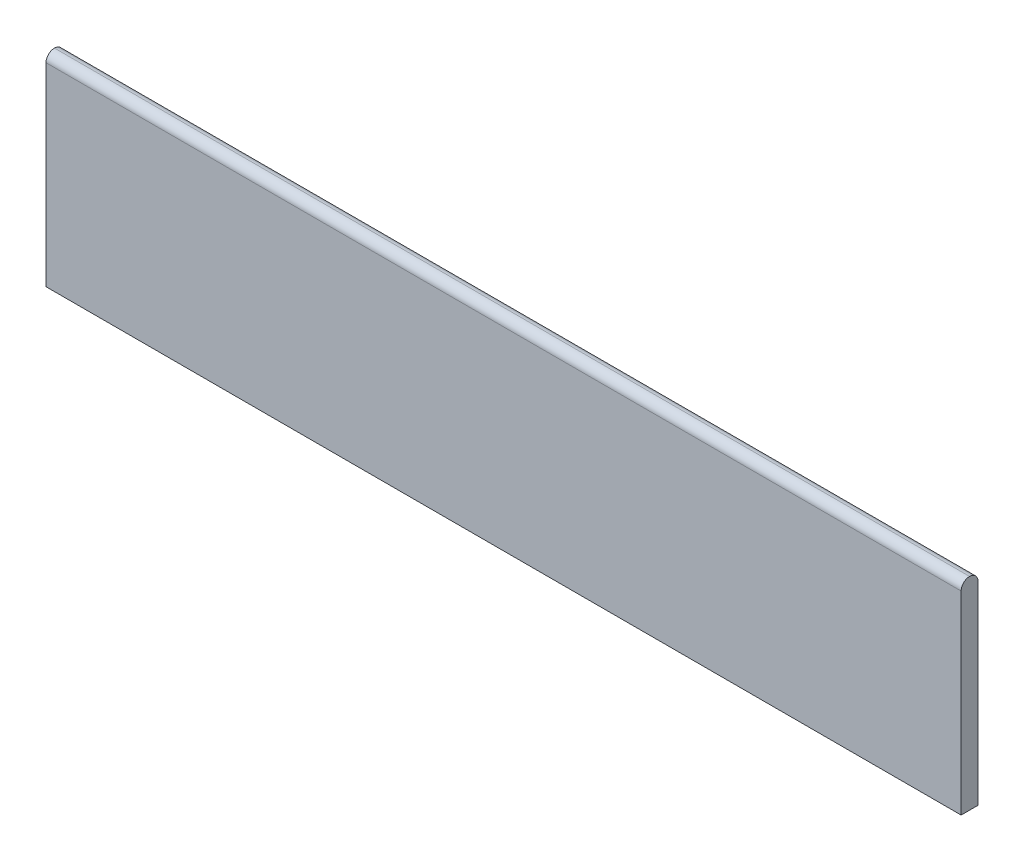
ISO-10303-21;
HEADER;
FILE_DESCRIPTION(('STEP AP214'),'2;1');
FILE_NAME('part.step','',(''),(''),'','','');
FILE_SCHEMA(('AUTOMOTIVE_DESIGN { 1 0 10303 214 1 1 1 1 }'));
ENDSEC;
DATA;
#1=APPLICATION_CONTEXT('core data for automotive mechanical design processes');
#2=APPLICATION_PROTOCOL_DEFINITION('international standard','automotive_design',2000,#1);
#3=PRODUCT_CONTEXT('',#1,'mechanical');
#4=PRODUCT('Part','Part','',(#3));
#5=PRODUCT_RELATED_PRODUCT_CATEGORY('part','',(#4));
#6=PRODUCT_DEFINITION_FORMATION('','',#4);
#7=PRODUCT_DEFINITION_CONTEXT('part definition',#1,'design');
#8=PRODUCT_DEFINITION('design','',#6,#7);
#9=PRODUCT_DEFINITION_SHAPE('','',#8);
#10=(LENGTH_UNIT() NAMED_UNIT(*) SI_UNIT(.MILLI.,.METRE.));
#11=(NAMED_UNIT(*) PLANE_ANGLE_UNIT() SI_UNIT($,.RADIAN.));
#12=(NAMED_UNIT(*) SI_UNIT($,.STERADIAN.) SOLID_ANGLE_UNIT());
#13=UNCERTAINTY_MEASURE_WITH_UNIT(LENGTH_MEASURE(1.E-05),#10,'distance_accuracy_value','');
#14=(GEOMETRIC_REPRESENTATION_CONTEXT(3) GLOBAL_UNCERTAINTY_ASSIGNED_CONTEXT((#13)) GLOBAL_UNIT_ASSIGNED_CONTEXT((#10,
#11,#12)) REPRESENTATION_CONTEXT('',''));
#15=CARTESIAN_POINT('',(0.,0.,0.));
#16=DIRECTION('',(0.,0.,1.));
#17=DIRECTION('',(1.,0.,0.));
#18=AXIS2_PLACEMENT_3D('',#15,#16,#17);
#19=CARTESIAN_POINT('',(0.,0.,12.5));
#20=DIRECTION('',(1.,0.,0.));
#21=DIRECTION('',(0.,0.,-1.));
#22=AXIS2_PLACEMENT_3D('',#19,#20,#21);
#23=PLANE('',#22);
#24=CARTESIAN_POINT('',(0.,143.75,6.25));
#25=DIRECTION('',(1.,0.,0.));
#26=DIRECTION('',(0.,0.,-1.));
#27=AXIS2_PLACEMENT_3D('',#24,#25,#26);
#28=CIRCLE('',#27,6.25);
#29=CARTESIAN_POINT('',(0.,143.75,12.5));
#30=VERTEX_POINT('',#29);
#31=CARTESIAN_POINT('',(0.,150.,6.25));
#32=VERTEX_POINT('',#31);
#33=EDGE_CURVE('E103',#30,#32,#28,.F.);
#34=ORIENTED_EDGE('',*,*,#33,.T.);
#35=CARTESIAN_POINT('',(0.,143.75,6.25));
#36=DIRECTION('',(1.,0.,0.));
#37=DIRECTION('',(0.,0.,-1.));
#38=AXIS2_PLACEMENT_3D('',#35,#36,#37);
#39=CIRCLE('',#38,6.25);
#40=CARTESIAN_POINT('',(0.,143.75,0.));
#41=VERTEX_POINT('',#40);
#42=EDGE_CURVE('E56',#32,#41,#39,.F.);
#43=ORIENTED_EDGE('',*,*,#42,.T.);
#44=DIRECTION('',(0.,-1.,0.));
#45=VECTOR('',#44,1.);
#46=CARTESIAN_POINT('',(0.,0.,0.));
#47=LINE('',#46,#45);
#48=CARTESIAN_POINT('',(0.,0.,0.));
#49=VERTEX_POINT('',#48);
#50=EDGE_CURVE('E100',#41,#49,#47,.T.);
#51=ORIENTED_EDGE('',*,*,#50,.T.);
#52=DIRECTION('',(0.,0.,-1.));
#53=VECTOR('',#52,1.);
#54=CARTESIAN_POINT('',(0.,0.,12.5));
#55=LINE('',#54,#53);
#56=CARTESIAN_POINT('',(0.,0.,12.5));
#57=VERTEX_POINT('',#56);
#58=EDGE_CURVE('E94',#57,#49,#55,.T.);
#59=ORIENTED_EDGE('',*,*,#58,.F.);
#60=DIRECTION('',(0.,-1.,0.));
#61=VECTOR('',#60,1.);
#62=CARTESIAN_POINT('',(0.,0.,12.5));
#63=LINE('',#62,#61);
#64=EDGE_CURVE('E80',#30,#57,#63,.T.);
#65=ORIENTED_EDGE('',*,*,#64,.F.);
#66=EDGE_LOOP('',(#34,#43,#51,#59,#65));
#67=FACE_BOUND('',#66,.T.);
#68=ADVANCED_FACE('F34',(#67),#23,.F.);
#69=CARTESIAN_POINT('',(0.,0.,12.5));
#70=DIRECTION('',(0.,1.,0.));
#71=DIRECTION('',(0.,0.,1.));
#72=AXIS2_PLACEMENT_3D('',#69,#70,#71);
#73=PLANE('',#72);
#74=DIRECTION('',(1.,0.,0.));
#75=VECTOR('',#74,1.);
#76=CARTESIAN_POINT('',(0.,0.,0.));
#77=LINE('',#76,#75);
#78=CARTESIAN_POINT('',(678.,0.,0.));
#79=VERTEX_POINT('',#78);
#80=EDGE_CURVE('E178',#49,#79,#77,.T.);
#81=ORIENTED_EDGE('',*,*,#80,.T.);
#82=DIRECTION('',(0.,0.,-1.));
#83=VECTOR('',#82,1.);
#84=CARTESIAN_POINT('',(678.,0.,12.5));
#85=LINE('',#84,#83);
#86=CARTESIAN_POINT('',(678.,0.,12.5));
#87=VERTEX_POINT('',#86);
#88=EDGE_CURVE('E96',#87,#79,#85,.T.);
#89=ORIENTED_EDGE('',*,*,#88,.F.);
#90=DIRECTION('',(1.,0.,0.));
#91=VECTOR('',#90,1.);
#92=CARTESIAN_POINT('',(0.,0.,12.5));
#93=LINE('',#92,#91);
#94=EDGE_CURVE('E84',#57,#87,#93,.T.);
#95=ORIENTED_EDGE('',*,*,#94,.F.);
#96=ORIENTED_EDGE('',*,*,#58,.T.);
#97=EDGE_LOOP('',(#81,#89,#95,#96));
#98=FACE_BOUND('',#97,.T.);
#99=ADVANCED_FACE('F93',(#98),#73,.F.);
#100=CARTESIAN_POINT('',(678.,0.,12.5));
#101=DIRECTION('',(-1.,0.,0.));
#102=DIRECTION('',(0.,0.,1.));
#103=AXIS2_PLACEMENT_3D('',#100,#101,#102);
#104=PLANE('',#103);
#105=DIRECTION('',(0.,1.,0.));
#106=VECTOR('',#105,1.);
#107=CARTESIAN_POINT('',(678.,0.,0.));
#108=LINE('',#107,#106);
#109=CARTESIAN_POINT('',(678.,143.75,0.));
#110=VERTEX_POINT('',#109);
#111=EDGE_CURVE('E89',#79,#110,#108,.T.);
#112=ORIENTED_EDGE('',*,*,#111,.T.);
#113=CARTESIAN_POINT('',(678.,143.75,6.25));
#114=DIRECTION('',(-1.,0.,0.));
#115=DIRECTION('',(0.,0.,1.));
#116=AXIS2_PLACEMENT_3D('',#113,#114,#115);
#117=CIRCLE('',#116,6.25);
#118=CARTESIAN_POINT('',(678.,150.,6.25));
#119=VERTEX_POINT('',#118);
#120=EDGE_CURVE('E11',#110,#119,#117,.F.);
#121=ORIENTED_EDGE('',*,*,#120,.T.);
#122=CARTESIAN_POINT('',(678.,143.75,6.25));
#123=DIRECTION('',(-1.,0.,0.));
#124=DIRECTION('',(0.,0.,1.));
#125=AXIS2_PLACEMENT_3D('',#122,#123,#124);
#126=CIRCLE('',#125,6.25);
#127=CARTESIAN_POINT('',(678.,143.75,12.5));
#128=VERTEX_POINT('',#127);
#129=EDGE_CURVE('E112',#119,#128,#126,.F.);
#130=ORIENTED_EDGE('',*,*,#129,.T.);
#131=DIRECTION('',(0.,1.,0.));
#132=VECTOR('',#131,1.);
#133=CARTESIAN_POINT('',(678.,0.,12.5));
#134=LINE('',#133,#132);
#135=EDGE_CURVE('E98',#87,#128,#134,.T.);
#136=ORIENTED_EDGE('',*,*,#135,.F.);
#137=ORIENTED_EDGE('',*,*,#88,.T.);
#138=EDGE_LOOP('',(#112,#121,#130,#136,#137));
#139=FACE_BOUND('',#138,.T.);
#140=ADVANCED_FACE('F116',(#139),#104,.F.);
#141=CARTESIAN_POINT('',(0.,0.,12.5));
#142=DIRECTION('',(0.,0.,-1.));
#143=DIRECTION('',(-1.,0.,0.));
#144=AXIS2_PLACEMENT_3D('',#141,#142,#143);
#145=PLANE('',#144);
#146=ORIENTED_EDGE('',*,*,#135,.T.);
#147=DIRECTION('',(-1.,0.,0.));
#148=VECTOR('',#147,1.);
#149=CARTESIAN_POINT('',(0.,143.75,12.5));
#150=LINE('',#149,#148);
#151=EDGE_CURVE('E87',#128,#30,#150,.T.);
#152=ORIENTED_EDGE('',*,*,#151,.T.);
#153=ORIENTED_EDGE('',*,*,#64,.T.);
#154=ORIENTED_EDGE('',*,*,#94,.T.);
#155=EDGE_LOOP('',(#146,#152,#153,#154));
#156=FACE_BOUND('',#155,.T.);
#157=ADVANCED_FACE('F83',(#156),#145,.F.);
#158=CARTESIAN_POINT('',(0.,0.,0.));
#159=DIRECTION('',(0.,0.,-1.));
#160=DIRECTION('',(-1.,0.,0.));
#161=AXIS2_PLACEMENT_3D('',#158,#159,#160);
#162=PLANE('',#161);
#163=ORIENTED_EDGE('',*,*,#50,.F.);
#164=DIRECTION('',(-1.,0.,0.));
#165=VECTOR('',#164,1.);
#166=CARTESIAN_POINT('',(678.,143.75,0.));
#167=LINE('',#166,#165);
#168=EDGE_CURVE('E42',#41,#110,#167,.F.);
#169=ORIENTED_EDGE('',*,*,#168,.T.);
#170=ORIENTED_EDGE('',*,*,#111,.F.);
#171=ORIENTED_EDGE('',*,*,#80,.F.);
#172=EDGE_LOOP('',(#163,#169,#170,#171));
#173=FACE_BOUND('',#172,.T.);
#174=ADVANCED_FACE('F127',(#173),#162,.T.);
#175=CARTESIAN_POINT('',(0.,143.75,6.25));
#176=DIRECTION('',(-1.,0.,0.));
#177=DIRECTION('',(0.,0.,1.));
#178=AXIS2_PLACEMENT_3D('',#175,#176,#177);
#179=CYLINDRICAL_SURFACE('',#178,6.25);
#180=ORIENTED_EDGE('',*,*,#129,.F.);
#181=DIRECTION('',(-1.,0.,0.));
#182=VECTOR('',#181,1.);
#183=CARTESIAN_POINT('',(0.,150.,6.25));
#184=LINE('',#183,#182);
#185=EDGE_CURVE('E109',#32,#119,#184,.F.);
#186=ORIENTED_EDGE('',*,*,#185,.F.);
#187=ORIENTED_EDGE('',*,*,#33,.F.);
#188=ORIENTED_EDGE('',*,*,#151,.F.);
#189=EDGE_LOOP('',(#180,#186,#187,#188));
#190=FACE_BOUND('',#189,.T.);
#191=ADVANCED_FACE('F121',(#190),#179,.T.);
#192=CARTESIAN_POINT('',(0.,143.75,6.25));
#193=DIRECTION('',(1.,0.,0.));
#194=DIRECTION('',(0.,0.,-1.));
#195=AXIS2_PLACEMENT_3D('',#192,#193,#194);
#196=CYLINDRICAL_SURFACE('',#195,6.25);
#197=ORIENTED_EDGE('',*,*,#120,.F.);
#198=ORIENTED_EDGE('',*,*,#168,.F.);
#199=ORIENTED_EDGE('',*,*,#42,.F.);
#200=ORIENTED_EDGE('',*,*,#185,.T.);
#201=EDGE_LOOP('',(#197,#198,#199,#200));
#202=FACE_BOUND('',#201,.T.);
#203=ADVANCED_FACE('F36',(#202),#196,.T.);
#204=CLOSED_SHELL('',(#68,#99,#140,#157,#174,#191,#203));
#205=MANIFOLD_SOLID_BREP('B2',#204);
#206=ADVANCED_BREP_SHAPE_REPRESENTATION('',(#18,#205),#14);
#207=SHAPE_DEFINITION_REPRESENTATION(#9,#206);
ENDSEC;
END-ISO-10303-21;
